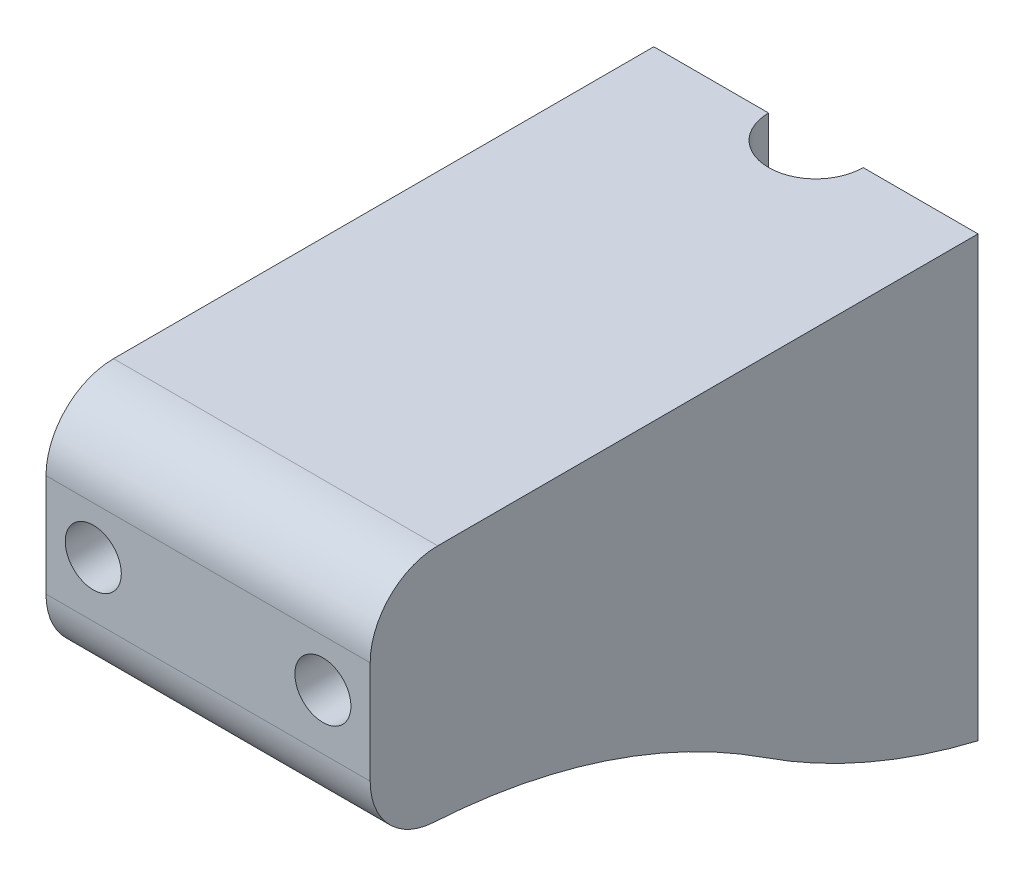
ISO-10303-21;
HEADER;
FILE_DESCRIPTION(('STEP AP214'),'2;1');
FILE_NAME('part.step','',(''),(''),'','','');
FILE_SCHEMA(('AUTOMOTIVE_DESIGN { 1 0 10303 214 1 1 1 1 }'));
ENDSEC;
DATA;
#1=APPLICATION_CONTEXT('core data for automotive mechanical design processes');
#2=APPLICATION_PROTOCOL_DEFINITION('international standard','automotive_design',2000,#1);
#3=PRODUCT_CONTEXT('',#1,'mechanical');
#4=PRODUCT('Part','Part','',(#3));
#5=PRODUCT_RELATED_PRODUCT_CATEGORY('part','',(#4));
#6=PRODUCT_DEFINITION_FORMATION('','',#4);
#7=PRODUCT_DEFINITION_CONTEXT('part definition',#1,'design');
#8=PRODUCT_DEFINITION('design','',#6,#7);
#9=PRODUCT_DEFINITION_SHAPE('','',#8);
#10=(LENGTH_UNIT() NAMED_UNIT(*) SI_UNIT(.MILLI.,.METRE.));
#11=(NAMED_UNIT(*) PLANE_ANGLE_UNIT() SI_UNIT($,.RADIAN.));
#12=(NAMED_UNIT(*) SI_UNIT($,.STERADIAN.) SOLID_ANGLE_UNIT());
#13=UNCERTAINTY_MEASURE_WITH_UNIT(LENGTH_MEASURE(1.E-05),#10,'distance_accuracy_value','');
#14=(GEOMETRIC_REPRESENTATION_CONTEXT(3) GLOBAL_UNCERTAINTY_ASSIGNED_CONTEXT((#13)) GLOBAL_UNIT_ASSIGNED_CONTEXT((#10,
#11,#12)) REPRESENTATION_CONTEXT('',''));
#15=CARTESIAN_POINT('',(0.,0.,0.));
#16=DIRECTION('',(0.,0.,1.));
#17=DIRECTION('',(1.,0.,0.));
#18=AXIS2_PLACEMENT_3D('',#15,#16,#17);
#19=CARTESIAN_POINT('',(24.,70.,-45.));
#20=DIRECTION('',(0.,0.,1.));
#21=DIRECTION('',(1.,0.,0.));
#22=AXIS2_PLACEMENT_3D('',#19,#20,#21);
#23=PLANE('',#22);
#24=CARTESIAN_POINT('',(-17.,53.,-45.));
#25=DIRECTION('',(0.,0.,1.));
#26=DIRECTION('',(1.,0.,0.));
#27=AXIS2_PLACEMENT_3D('',#24,#25,#26);
#28=CIRCLE('',#27,4.15);
#29=CARTESIAN_POINT('',(-12.85,53.,-45.));
#30=VERTEX_POINT('',#29);
#31=EDGE_CURVE('E213',#30,#30,#28,.T.);
#32=ORIENTED_EDGE('',*,*,#31,.T.);
#33=EDGE_LOOP('',(#32));
#34=FACE_BOUND('',#33,.T.);
#35=DIRECTION('',(0.,-1.,0.));
#36=VECTOR('',#35,1.);
#37=CARTESIAN_POINT('',(-7.,244.504586917703,-45.));
#38=LINE('',#37,#36);
#39=CARTESIAN_POINT('',(-7.,70.,-45.));
#40=VERTEX_POINT('',#39);
#41=CARTESIAN_POINT('',(-7.,5.,-45.));
#42=VERTEX_POINT('',#41);
#43=EDGE_CURVE('E158',#40,#42,#38,.T.);
#44=ORIENTED_EDGE('',*,*,#43,.T.);
#45=DIRECTION('',(1.,0.,0.));
#46=VECTOR('',#45,1.);
#47=CARTESIAN_POINT('',(-7.,5.,-45.));
#48=LINE('',#47,#46);
#49=CARTESIAN_POINT('',(-24.,5.,-45.));
#50=VERTEX_POINT('',#49);
#51=EDGE_CURVE('E156',#50,#42,#48,.T.);
#52=ORIENTED_EDGE('',*,*,#51,.F.);
#53=DIRECTION('',(0.,-1.,0.));
#54=VECTOR('',#53,1.);
#55=CARTESIAN_POINT('',(-24.,70.,-45.));
#56=LINE('',#55,#54);
#57=CARTESIAN_POINT('',(-24.,70.,-45.));
#58=VERTEX_POINT('',#57);
#59=EDGE_CURVE('E141',#58,#50,#56,.T.);
#60=ORIENTED_EDGE('',*,*,#59,.F.);
#61=DIRECTION('',(-1.,0.,0.));
#62=VECTOR('',#61,1.);
#63=CARTESIAN_POINT('',(24.,70.,-45.));
#64=LINE('',#63,#62);
#65=EDGE_CURVE('E221',#40,#58,#64,.T.);
#66=ORIENTED_EDGE('',*,*,#65,.F.);
#67=EDGE_LOOP('',(#44,#52,#60,#66));
#68=FACE_BOUND('',#67,.T.);
#69=ADVANCED_FACE('F35',(#34,#68),#23,.F.);
#70=CARTESIAN_POINT('',(17.,53.,-45.));
#71=DIRECTION('',(0.,0.,1.));
#72=DIRECTION('',(1.,0.,0.));
#73=AXIS2_PLACEMENT_3D('',#70,#71,#72);
#74=CIRCLE('',#73,4.15);
#75=CARTESIAN_POINT('',(21.15,53.,-45.));
#76=VERTEX_POINT('',#75);
#77=EDGE_CURVE('E274',#76,#76,#74,.T.);
#78=ORIENTED_EDGE('',*,*,#77,.T.);
#79=EDGE_LOOP('',(#78));
#80=FACE_BOUND('',#79,.T.);
#81=DIRECTION('',(0.,-1.,0.));
#82=VECTOR('',#81,1.);
#83=CARTESIAN_POINT('',(24.,70.,-45.));
#84=LINE('',#83,#82);
#85=CARTESIAN_POINT('',(24.,70.,-45.));
#86=VERTEX_POINT('',#85);
#87=CARTESIAN_POINT('',(24.,5.,-45.));
#88=VERTEX_POINT('',#87);
#89=EDGE_CURVE('E151',#86,#88,#84,.T.);
#90=ORIENTED_EDGE('',*,*,#89,.T.);
#91=DIRECTION('',(1.,0.,0.));
#92=VECTOR('',#91,1.);
#93=CARTESIAN_POINT('',(24.,5.,-45.));
#94=LINE('',#93,#92);
#95=CARTESIAN_POINT('',(7.,5.,-45.));
#96=VERTEX_POINT('',#95);
#97=EDGE_CURVE('E160',#96,#88,#94,.T.);
#98=ORIENTED_EDGE('',*,*,#97,.F.);
#99=DIRECTION('',(0.,-1.,0.));
#100=VECTOR('',#99,1.);
#101=CARTESIAN_POINT('',(7.,244.504586917703,-45.));
#102=LINE('',#101,#100);
#103=CARTESIAN_POINT('',(7.,70.,-45.));
#104=VERTEX_POINT('',#103);
#105=EDGE_CURVE('E282',#104,#96,#102,.T.);
#106=ORIENTED_EDGE('',*,*,#105,.F.);
#107=EDGE_CURVE('E152',#86,#104,#64,.T.);
#108=ORIENTED_EDGE('',*,*,#107,.F.);
#109=EDGE_LOOP('',(#90,#98,#106,#108));
#110=FACE_BOUND('',#109,.T.);
#111=ADVANCED_FACE('F289',(#80,#110),#23,.F.);
#112=CARTESIAN_POINT('',(0.,70.,0.));
#113=DIRECTION('',(0.,1.,0.));
#114=DIRECTION('',(0.,0.,1.));
#115=AXIS2_PLACEMENT_3D('',#112,#113,#114);
#116=PLANE('',#115);
#117=DIRECTION('',(0.,0.,1.));
#118=VECTOR('',#117,1.);
#119=CARTESIAN_POINT('',(-24.,70.,45.));
#120=LINE('',#119,#118);
#121=CARTESIAN_POINT('',(-24.,70.,35.));
#122=VERTEX_POINT('',#121);
#123=EDGE_CURVE('E148',#58,#122,#120,.T.);
#124=ORIENTED_EDGE('',*,*,#123,.T.);
#125=DIRECTION('',(1.,0.,0.));
#126=VECTOR('',#125,1.);
#127=CARTESIAN_POINT('',(24.,70.,35.));
#128=LINE('',#127,#126);
#129=CARTESIAN_POINT('',(24.,70.,35.));
#130=VERTEX_POINT('',#129);
#131=EDGE_CURVE('E181',#122,#130,#128,.T.);
#132=ORIENTED_EDGE('',*,*,#131,.T.);
#133=DIRECTION('',(0.,0.,-1.));
#134=VECTOR('',#133,1.);
#135=CARTESIAN_POINT('',(24.,70.,45.));
#136=LINE('',#135,#134);
#137=EDGE_CURVE('E222',#130,#86,#136,.T.);
#138=ORIENTED_EDGE('',*,*,#137,.T.);
#139=ORIENTED_EDGE('',*,*,#107,.T.);
#140=CARTESIAN_POINT('',(0.,70.,-45.));
#141=DIRECTION('',(0.,1.,0.));
#142=DIRECTION('',(0.,0.,1.));
#143=AXIS2_PLACEMENT_3D('',#140,#141,#142);
#144=CIRCLE('',#143,7.);
#145=EDGE_CURVE('E278',#104,#40,#144,.F.);
#146=ORIENTED_EDGE('',*,*,#145,.T.);
#147=ORIENTED_EDGE('',*,*,#65,.T.);
#148=EDGE_LOOP('',(#124,#132,#138,#139,#146,#147));
#149=FACE_BOUND('',#148,.T.);
#150=ADVANCED_FACE('F307',(#149),#116,.T.);
#151=CARTESIAN_POINT('',(21.,0.,0.));
#152=DIRECTION('',(1.,0.,0.));
#153=DIRECTION('',(0.,0.,-1.));
#154=AXIS2_PLACEMENT_3D('',#151,#152,#153);
#155=PLANE('',#154);
#156=DIRECTION('',(0.,1.,0.));
#157=VECTOR('',#156,1.);
#158=CARTESIAN_POINT('',(21.,42.8,26.3));
#159=LINE('',#158,#157);
#160=CARTESIAN_POINT('',(21.,54.1056672193748,26.3));
#161=VERTEX_POINT('',#160);
#162=CARTESIAN_POINT('',(21.,63.2,26.3));
#163=VERTEX_POINT('',#162);
#164=EDGE_CURVE('E243',#161,#163,#159,.T.);
#165=ORIENTED_EDGE('',*,*,#164,.F.);
#166=DIRECTION('',(0.,0.,1.));
#167=VECTOR('',#166,1.);
#168=CARTESIAN_POINT('',(21.,54.1056672193748,-45.));
#169=LINE('',#168,#167);
#170=CARTESIAN_POINT('',(21.,54.1056672193748,36.7));
#171=VERTEX_POINT('',#170);
#172=EDGE_CURVE('E200',#161,#171,#169,.T.);
#173=ORIENTED_EDGE('',*,*,#172,.T.);
#174=DIRECTION('',(0.,-1.,0.));
#175=VECTOR('',#174,1.);
#176=CARTESIAN_POINT('',(21.,42.8,36.7));
#177=LINE('',#176,#175);
#178=CARTESIAN_POINT('',(21.,63.2,36.7));
#179=VERTEX_POINT('',#178);
#180=EDGE_CURVE('E247',#179,#171,#177,.T.);
#181=ORIENTED_EDGE('',*,*,#180,.F.);
#182=DIRECTION('',(0.,0.,1.));
#183=VECTOR('',#182,1.);
#184=CARTESIAN_POINT('',(21.,63.2,26.3));
#185=LINE('',#184,#183);
#186=EDGE_CURVE('E236',#163,#179,#185,.T.);
#187=ORIENTED_EDGE('',*,*,#186,.F.);
#188=EDGE_LOOP('',(#165,#173,#181,#187));
#189=FACE_BOUND('',#188,.T.);
#190=ADVANCED_FACE('F321',(#189),#155,.F.);
#191=CARTESIAN_POINT('',(-24.,70.,45.));
#192=DIRECTION('',(1.,0.,0.));
#193=DIRECTION('',(0.,0.,-1.));
#194=AXIS2_PLACEMENT_3D('',#191,#192,#193);
#195=PLANE('',#194);
#196=DIRECTION('',(0.,0.,1.));
#197=VECTOR('',#196,1.);
#198=CARTESIAN_POINT('',(-24.,63.2,26.3));
#199=LINE('',#198,#197);
#200=CARTESIAN_POINT('',(-24.,63.2,26.3));
#201=VERTEX_POINT('',#200);
#202=CARTESIAN_POINT('',(-24.,63.2,36.7));
#203=VERTEX_POINT('',#202);
#204=EDGE_CURVE('E230',#201,#203,#199,.T.);
#205=ORIENTED_EDGE('',*,*,#204,.T.);
#206=DIRECTION('',(0.,-1.,0.));
#207=VECTOR('',#206,1.);
#208=CARTESIAN_POINT('',(-24.,42.8,36.7));
#209=LINE('',#208,#207);
#210=CARTESIAN_POINT('',(-24.,42.8,36.7));
#211=VERTEX_POINT('',#210);
#212=EDGE_CURVE('E239',#203,#211,#209,.T.);
#213=ORIENTED_EDGE('',*,*,#212,.T.);
#214=DIRECTION('',(0.,0.,-1.));
#215=VECTOR('',#214,1.);
#216=CARTESIAN_POINT('',(-24.,42.8,26.3));
#217=LINE('',#216,#215);
#218=CARTESIAN_POINT('',(-24.,42.8,26.3));
#219=VERTEX_POINT('',#218);
#220=EDGE_CURVE('E256',#211,#219,#217,.T.);
#221=ORIENTED_EDGE('',*,*,#220,.T.);
#222=DIRECTION('',(0.,1.,0.));
#223=VECTOR('',#222,1.);
#224=CARTESIAN_POINT('',(-24.,42.8,26.3));
#225=LINE('',#224,#223);
#226=EDGE_CURVE('E253',#219,#201,#225,.T.);
#227=ORIENTED_EDGE('',*,*,#226,.T.);
#228=EDGE_LOOP('',(#205,#213,#221,#227));
#229=FACE_BOUND('',#228,.T.);
#230=CARTESIAN_POINT('',(-24.,-65.,41.3970234266202));
#231=DIRECTION('',(1.,0.,0.));
#232=DIRECTION('',(0.,0.,-1.));
#233=AXIS2_PLACEMENT_3D('',#230,#231,#232);
#234=CIRCLE('',#233,100.);
#235=CARTESIAN_POINT('',(-24.,18.6283238276554,-13.4327445263523));
#236=VERTEX_POINT('',#235);
#237=CARTESIAN_POINT('',(-24.,34.8307579893425,35.5815475842382));
#238=VERTEX_POINT('',#237);
#239=EDGE_CURVE('E197',#236,#238,#234,.T.);
#240=ORIENTED_EDGE('',*,*,#239,.T.);
#241=CARTESIAN_POINT('',(-24.,44.8138337882767,35.));
#242=DIRECTION('',(1.,0.,0.));
#243=DIRECTION('',(0.,0.,-1.));
#244=AXIS2_PLACEMENT_3D('',#241,#242,#243);
#245=CIRCLE('',#244,10.);
#246=CARTESIAN_POINT('',(-24.,44.8138337882767,45.));
#247=VERTEX_POINT('',#246);
#248=EDGE_CURVE('E57',#238,#247,#245,.F.);
#249=ORIENTED_EDGE('',*,*,#248,.T.);
#250=DIRECTION('',(0.,-1.,0.));
#251=VECTOR('',#250,1.);
#252=CARTESIAN_POINT('',(-24.,70.,45.));
#253=LINE('',#252,#251);
#254=CARTESIAN_POINT('',(-24.,60.,45.));
#255=VERTEX_POINT('',#254);
#256=EDGE_CURVE('E208',#255,#247,#253,.T.);
#257=ORIENTED_EDGE('',*,*,#256,.F.);
#258=CARTESIAN_POINT('',(-24.,60.,35.));
#259=DIRECTION('',(1.,0.,0.));
#260=DIRECTION('',(0.,0.,-1.));
#261=AXIS2_PLACEMENT_3D('',#258,#259,#260);
#262=CIRCLE('',#261,10.);
#263=EDGE_CURVE('E188',#255,#122,#262,.F.);
#264=ORIENTED_EDGE('',*,*,#263,.T.);
#265=ORIENTED_EDGE('',*,*,#123,.F.);
#266=ORIENTED_EDGE('',*,*,#59,.T.);
#267=CARTESIAN_POINT('',(-24.,102.256647655311,-68.2625124793248));
#268=DIRECTION('',(1.,0.,0.));
#269=DIRECTION('',(0.,0.,-1.));
#270=AXIS2_PLACEMENT_3D('',#267,#268,#269);
#271=CIRCLE('',#270,100.);
#272=EDGE_CURVE('E145',#50,#236,#271,.F.);
#273=ORIENTED_EDGE('',*,*,#272,.T.);
#274=EDGE_LOOP('',(#240,#249,#257,#264,#265,#266,#273));
#275=FACE_BOUND('',#274,.T.);
#276=ADVANCED_FACE('F143',(#229,#275),#195,.F.);
#277=CARTESIAN_POINT('',(24.,70.,45.));
#278=DIRECTION('',(0.,0.,-1.));
#279=DIRECTION('',(-1.,0.,0.));
#280=AXIS2_PLACEMENT_3D('',#277,#278,#279);
#281=PLANE('',#280);
#282=CARTESIAN_POINT('',(17.,53.,45.));
#283=DIRECTION('',(0.,0.,1.));
#284=DIRECTION('',(1.,0.,0.));
#285=AXIS2_PLACEMENT_3D('',#282,#283,#284);
#286=CIRCLE('',#285,4.15);
#287=CARTESIAN_POINT('',(21.15,53.,45.));
#288=VERTEX_POINT('',#287);
#289=EDGE_CURVE('E275',#288,#288,#286,.T.);
#290=ORIENTED_EDGE('',*,*,#289,.F.);
#291=EDGE_LOOP('',(#290));
#292=FACE_BOUND('',#291,.T.);
#293=CARTESIAN_POINT('',(-17.,53.,45.));
#294=DIRECTION('',(0.,0.,1.));
#295=DIRECTION('',(1.,0.,0.));
#296=AXIS2_PLACEMENT_3D('',#293,#294,#295);
#297=CIRCLE('',#296,4.15);
#298=CARTESIAN_POINT('',(-12.85,53.,45.));
#299=VERTEX_POINT('',#298);
#300=EDGE_CURVE('E263',#299,#299,#297,.T.);
#301=ORIENTED_EDGE('',*,*,#300,.F.);
#302=EDGE_LOOP('',(#301));
#303=FACE_BOUND('',#302,.T.);
#304=ORIENTED_EDGE('',*,*,#256,.T.);
#305=DIRECTION('',(-1.,0.,0.));
#306=VECTOR('',#305,1.);
#307=CARTESIAN_POINT('',(24.,44.8138337882767,45.));
#308=LINE('',#307,#306);
#309=CARTESIAN_POINT('',(24.,44.8138337882767,45.));
#310=VERTEX_POINT('',#309);
#311=EDGE_CURVE('E43',#247,#310,#308,.F.);
#312=ORIENTED_EDGE('',*,*,#311,.T.);
#313=DIRECTION('',(0.,-1.,0.));
#314=VECTOR('',#313,1.);
#315=CARTESIAN_POINT('',(24.,70.,45.));
#316=LINE('',#315,#314);
#317=CARTESIAN_POINT('',(24.,60.,45.));
#318=VERTEX_POINT('',#317);
#319=EDGE_CURVE('E215',#318,#310,#316,.T.);
#320=ORIENTED_EDGE('',*,*,#319,.F.);
#321=DIRECTION('',(1.,0.,0.));
#322=VECTOR('',#321,1.);
#323=CARTESIAN_POINT('',(-24.,60.,45.));
#324=LINE('',#323,#322);
#325=EDGE_CURVE('E186',#318,#255,#324,.F.);
#326=ORIENTED_EDGE('',*,*,#325,.T.);
#327=EDGE_LOOP('',(#304,#312,#320,#326));
#328=FACE_BOUND('',#327,.T.);
#329=ADVANCED_FACE('F315',(#292,#303,#328),#281,.F.);
#330=CARTESIAN_POINT('',(24.,70.,45.));
#331=DIRECTION('',(-1.,0.,0.));
#332=DIRECTION('',(0.,0.,1.));
#333=AXIS2_PLACEMENT_3D('',#330,#331,#332);
#334=PLANE('',#333);
#335=ORIENTED_EDGE('',*,*,#319,.T.);
#336=CARTESIAN_POINT('',(24.,44.8138337882767,35.));
#337=DIRECTION('',(-1.,0.,0.));
#338=DIRECTION('',(0.,0.,1.));
#339=AXIS2_PLACEMENT_3D('',#336,#337,#338);
#340=CIRCLE('',#339,10.);
#341=CARTESIAN_POINT('',(24.,34.8307579893425,35.5815475842382));
#342=VERTEX_POINT('',#341);
#343=EDGE_CURVE('E11',#310,#342,#340,.F.);
#344=ORIENTED_EDGE('',*,*,#343,.T.);
#345=CARTESIAN_POINT('',(24.,-65.,41.3970234266202));
#346=DIRECTION('',(-1.,0.,0.));
#347=DIRECTION('',(0.,0.,1.));
#348=AXIS2_PLACEMENT_3D('',#345,#346,#347);
#349=CIRCLE('',#348,100.);
#350=CARTESIAN_POINT('',(24.,18.6283238276554,-13.4327445263523));
#351=VERTEX_POINT('',#350);
#352=EDGE_CURVE('E171',#342,#351,#349,.T.);
#353=ORIENTED_EDGE('',*,*,#352,.T.);
#354=CARTESIAN_POINT('',(24.,102.256647655311,-68.2625124793248));
#355=DIRECTION('',(-1.,0.,0.));
#356=DIRECTION('',(0.,0.,1.));
#357=AXIS2_PLACEMENT_3D('',#354,#355,#356);
#358=CIRCLE('',#357,100.);
#359=EDGE_CURVE('E169',#351,#88,#358,.F.);
#360=ORIENTED_EDGE('',*,*,#359,.T.);
#361=ORIENTED_EDGE('',*,*,#89,.F.);
#362=ORIENTED_EDGE('',*,*,#137,.F.);
#363=CARTESIAN_POINT('',(24.,60.,35.));
#364=DIRECTION('',(-1.,0.,0.));
#365=DIRECTION('',(0.,0.,1.));
#366=AXIS2_PLACEMENT_3D('',#363,#364,#365);
#367=CIRCLE('',#366,10.);
#368=EDGE_CURVE('E184',#130,#318,#367,.F.);
#369=ORIENTED_EDGE('',*,*,#368,.T.);
#370=EDGE_LOOP('',(#335,#344,#353,#360,#361,#362,#369));
#371=FACE_BOUND('',#370,.T.);
#372=ADVANCED_FACE('F294',(#371),#334,.F.);
#373=CARTESIAN_POINT('',(-24.,42.8,36.7));
#374=DIRECTION('',(0.,0.,1.));
#375=DIRECTION('',(1.,0.,0.));
#376=AXIS2_PLACEMENT_3D('',#373,#374,#375);
#377=PLANE('',#376);
#378=CARTESIAN_POINT('',(-17.,53.,36.7));
#379=DIRECTION('',(0.,0.,1.));
#380=DIRECTION('',(1.,0.,0.));
#381=AXIS2_PLACEMENT_3D('',#378,#379,#380);
#382=CIRCLE('',#381,4.15);
#383=CARTESIAN_POINT('',(-12.85,53.,36.7));
#384=VERTEX_POINT('',#383);
#385=EDGE_CURVE('E212',#384,#384,#382,.T.);
#386=ORIENTED_EDGE('',*,*,#385,.T.);
#387=EDGE_LOOP('',(#386));
#388=FACE_BOUND('',#387,.T.);
#389=ORIENTED_EDGE('',*,*,#180,.T.);
#390=CARTESIAN_POINT('',(17.,53.,36.7));
#391=DIRECTION('',(0.,0.,1.));
#392=DIRECTION('',(1.,0.,0.));
#393=AXIS2_PLACEMENT_3D('',#390,#391,#392);
#394=CIRCLE('',#393,4.15);
#395=CARTESIAN_POINT('',(21.,51.8943327806252,36.7));
#396=VERTEX_POINT('',#395);
#397=EDGE_CURVE('E266',#171,#396,#394,.T.);
#398=ORIENTED_EDGE('',*,*,#397,.T.);
#399=CARTESIAN_POINT('',(21.,42.8,36.7));
#400=VERTEX_POINT('',#399);
#401=EDGE_CURVE('E250',#396,#400,#177,.T.);
#402=ORIENTED_EDGE('',*,*,#401,.T.);
#403=DIRECTION('',(1.,0.,0.));
#404=VECTOR('',#403,1.);
#405=CARTESIAN_POINT('',(-24.,42.8,36.7));
#406=LINE('',#405,#404);
#407=EDGE_CURVE('E226',#211,#400,#406,.T.);
#408=ORIENTED_EDGE('',*,*,#407,.F.);
#409=ORIENTED_EDGE('',*,*,#212,.F.);
#410=DIRECTION('',(1.,0.,0.));
#411=VECTOR('',#410,1.);
#412=CARTESIAN_POINT('',(-24.,63.2,36.7));
#413=LINE('',#412,#411);
#414=EDGE_CURVE('E225',#203,#179,#413,.T.);
#415=ORIENTED_EDGE('',*,*,#414,.T.);
#416=EDGE_LOOP('',(#389,#398,#402,#408,#409,#415));
#417=FACE_BOUND('',#416,.T.);
#418=ADVANCED_FACE('F314',(#388,#417),#377,.F.);
#419=CARTESIAN_POINT('',(-24.,63.2,26.3));
#420=DIRECTION('',(0.,1.,0.));
#421=DIRECTION('',(0.,0.,1.));
#422=AXIS2_PLACEMENT_3D('',#419,#420,#421);
#423=PLANE('',#422);
#424=ORIENTED_EDGE('',*,*,#186,.T.);
#425=ORIENTED_EDGE('',*,*,#414,.F.);
#426=ORIENTED_EDGE('',*,*,#204,.F.);
#427=DIRECTION('',(1.,0.,0.));
#428=VECTOR('',#427,1.);
#429=CARTESIAN_POINT('',(-24.,63.2,26.3));
#430=LINE('',#429,#428);
#431=EDGE_CURVE('E232',#201,#163,#430,.T.);
#432=ORIENTED_EDGE('',*,*,#431,.T.);
#433=EDGE_LOOP('',(#424,#425,#426,#432));
#434=FACE_BOUND('',#433,.T.);
#435=ADVANCED_FACE('F371',(#434),#423,.F.);
#436=CARTESIAN_POINT('',(-24.,42.8,26.3));
#437=DIRECTION('',(0.,0.,-1.));
#438=DIRECTION('',(0.,1.,0.));
#439=AXIS2_PLACEMENT_3D('',#436,#437,#438);
#440=PLANE('',#439);
#441=CARTESIAN_POINT('',(-17.,53.,26.3));
#442=DIRECTION('',(0.,0.,-1.));
#443=DIRECTION('',(0.,1.,0.));
#444=AXIS2_PLACEMENT_3D('',#441,#442,#443);
#445=CIRCLE('',#444,4.15);
#446=CARTESIAN_POINT('',(-12.85,53.,26.3));
#447=VERTEX_POINT('',#446);
#448=EDGE_CURVE('E209',#447,#447,#445,.T.);
#449=ORIENTED_EDGE('',*,*,#448,.T.);
#450=EDGE_LOOP('',(#449));
#451=FACE_BOUND('',#450,.T.);
#452=CARTESIAN_POINT('',(21.,42.8,26.3));
#453=VERTEX_POINT('',#452);
#454=CARTESIAN_POINT('',(21.,51.8943327806252,26.3));
#455=VERTEX_POINT('',#454);
#456=EDGE_CURVE('E240',#453,#455,#159,.T.);
#457=ORIENTED_EDGE('',*,*,#456,.T.);
#458=CARTESIAN_POINT('',(17.,53.,26.3));
#459=DIRECTION('',(0.,0.,-1.));
#460=DIRECTION('',(0.,1.,0.));
#461=AXIS2_PLACEMENT_3D('',#458,#459,#460);
#462=CIRCLE('',#461,4.15);
#463=EDGE_CURVE('E271',#455,#161,#462,.T.);
#464=ORIENTED_EDGE('',*,*,#463,.T.);
#465=ORIENTED_EDGE('',*,*,#164,.T.);
#466=ORIENTED_EDGE('',*,*,#431,.F.);
#467=ORIENTED_EDGE('',*,*,#226,.F.);
#468=DIRECTION('',(1.,0.,0.));
#469=VECTOR('',#468,1.);
#470=CARTESIAN_POINT('',(-24.,42.8,26.3));
#471=LINE('',#470,#469);
#472=EDGE_CURVE('E229',#219,#453,#471,.T.);
#473=ORIENTED_EDGE('',*,*,#472,.T.);
#474=EDGE_LOOP('',(#457,#464,#465,#466,#467,#473));
#475=FACE_BOUND('',#474,.T.);
#476=ADVANCED_FACE('F380',(#451,#475),#440,.F.);
#477=CARTESIAN_POINT('',(-24.,42.8,26.3));
#478=DIRECTION('',(0.,-1.,0.));
#479=DIRECTION('',(0.,0.,-1.));
#480=AXIS2_PLACEMENT_3D('',#477,#478,#479);
#481=PLANE('',#480);
#482=DIRECTION('',(0.,0.,-1.));
#483=VECTOR('',#482,1.);
#484=CARTESIAN_POINT('',(21.,42.8,26.3));
#485=LINE('',#484,#483);
#486=EDGE_CURVE('E244',#400,#453,#485,.T.);
#487=ORIENTED_EDGE('',*,*,#486,.T.);
#488=ORIENTED_EDGE('',*,*,#472,.F.);
#489=ORIENTED_EDGE('',*,*,#220,.F.);
#490=ORIENTED_EDGE('',*,*,#407,.T.);
#491=EDGE_LOOP('',(#487,#488,#489,#490));
#492=FACE_BOUND('',#491,.T.);
#493=ADVANCED_FACE('F388',(#492),#481,.F.);
#494=ORIENTED_EDGE('',*,*,#401,.F.);
#495=DIRECTION('',(0.,0.,1.));
#496=VECTOR('',#495,1.);
#497=CARTESIAN_POINT('',(21.,51.8943327806252,-45.));
#498=LINE('',#497,#496);
#499=EDGE_CURVE('E203',#396,#455,#498,.F.);
#500=ORIENTED_EDGE('',*,*,#499,.T.);
#501=ORIENTED_EDGE('',*,*,#456,.F.);
#502=ORIENTED_EDGE('',*,*,#486,.F.);
#503=EDGE_LOOP('',(#494,#500,#501,#502));
#504=FACE_BOUND('',#503,.T.);
#505=ADVANCED_FACE('F396',(#504),#155,.F.);
#506=CARTESIAN_POINT('',(-17.,53.,-45.));
#507=DIRECTION('',(0.,0.,1.));
#508=DIRECTION('',(1.,0.,0.));
#509=AXIS2_PLACEMENT_3D('',#506,#507,#508);
#510=CYLINDRICAL_SURFACE('',#509,4.15);
#511=CARTESIAN_POINT('',(-12.85,53.,-45.));
#512=CARTESIAN_POINT('',(-12.85,53.,-44.2572916666667));
#513=CARTESIAN_POINT('',(-12.85,53.,-43.5145833333333));
#514=CARTESIAN_POINT('',(-12.85,53.,-42.0291666666667));
#515=CARTESIAN_POINT('',(-12.85,53.,-41.2864583333333));
#516=CARTESIAN_POINT('',(-12.85,53.,-39.8010416666667));
#517=CARTESIAN_POINT('',(-12.85,53.,-39.0583333333333));
#518=CARTESIAN_POINT('',(-12.85,53.,-37.5729166666667));
#519=CARTESIAN_POINT('',(-12.85,53.,-36.8302083333333));
#520=CARTESIAN_POINT('',(-12.85,53.,-35.3447916666667));
#521=CARTESIAN_POINT('',(-12.85,53.,-34.6020833333333));
#522=CARTESIAN_POINT('',(-12.85,53.,-33.1166666666667));
#523=CARTESIAN_POINT('',(-12.85,53.,-32.3739583333333));
#524=CARTESIAN_POINT('',(-12.85,53.,-30.8885416666667));
#525=CARTESIAN_POINT('',(-12.85,53.,-30.1458333333333));
#526=CARTESIAN_POINT('',(-12.85,53.,-28.6604166666667));
#527=CARTESIAN_POINT('',(-12.85,53.,-27.9177083333333));
#528=CARTESIAN_POINT('',(-12.85,53.,-26.4322916666667));
#529=CARTESIAN_POINT('',(-12.85,53.,-25.6895833333333));
#530=CARTESIAN_POINT('',(-12.85,53.,-24.2041666666667));
#531=CARTESIAN_POINT('',(-12.85,53.,-23.4614583333333));
#532=CARTESIAN_POINT('',(-12.85,53.,-21.9760416666667));
#533=CARTESIAN_POINT('',(-12.85,53.,-21.2333333333333));
#534=CARTESIAN_POINT('',(-12.85,53.,-19.7479166666667));
#535=CARTESIAN_POINT('',(-12.85,53.,-19.0052083333333));
#536=CARTESIAN_POINT('',(-12.85,53.,-17.5197916666667));
#537=CARTESIAN_POINT('',(-12.85,53.,-16.7770833333333));
#538=CARTESIAN_POINT('',(-12.85,53.,-15.2916666666667));
#539=CARTESIAN_POINT('',(-12.85,53.,-14.5489583333333));
#540=CARTESIAN_POINT('',(-12.85,53.,-13.0635416666667));
#541=CARTESIAN_POINT('',(-12.85,53.,-12.3208333333333));
#542=CARTESIAN_POINT('',(-12.85,53.,-10.8354166666667));
#543=CARTESIAN_POINT('',(-12.85,53.,-10.0927083333333));
#544=CARTESIAN_POINT('',(-12.85,53.,-8.60729166666667));
#545=CARTESIAN_POINT('',(-12.85,53.,-7.86458333333333));
#546=CARTESIAN_POINT('',(-12.85,53.,-6.37916666666666));
#547=CARTESIAN_POINT('',(-12.85,53.,-5.63645833333333));
#548=CARTESIAN_POINT('',(-12.85,53.,-4.15104166666666));
#549=CARTESIAN_POINT('',(-12.85,53.,-3.40833333333333));
#550=CARTESIAN_POINT('',(-12.85,53.,-1.92291666666666));
#551=CARTESIAN_POINT('',(-12.85,53.,-1.18020833333333));
#552=CARTESIAN_POINT('',(-12.85,53.,0.305208333333339));
#553=CARTESIAN_POINT('',(-12.85,53.,1.04791666666667));
#554=CARTESIAN_POINT('',(-12.85,53.,2.53333333333334));
#555=CARTESIAN_POINT('',(-12.85,53.,3.27604166666667));
#556=CARTESIAN_POINT('',(-12.85,53.,4.76145833333334));
#557=CARTESIAN_POINT('',(-12.85,53.,5.50416666666667));
#558=CARTESIAN_POINT('',(-12.85,53.,6.98958333333334));
#559=CARTESIAN_POINT('',(-12.85,53.,7.73229166666667));
#560=CARTESIAN_POINT('',(-12.85,53.,9.21770833333334));
#561=CARTESIAN_POINT('',(-12.85,53.,9.96041666666667));
#562=CARTESIAN_POINT('',(-12.85,53.,11.4458333333333));
#563=CARTESIAN_POINT('',(-12.85,53.,12.1885416666667));
#564=CARTESIAN_POINT('',(-12.85,53.,13.6739583333333));
#565=CARTESIAN_POINT('',(-12.85,53.,14.4166666666667));
#566=CARTESIAN_POINT('',(-12.85,53.,15.9020833333333));
#567=CARTESIAN_POINT('',(-12.85,53.,16.6447916666667));
#568=CARTESIAN_POINT('',(-12.85,53.,18.1302083333333));
#569=CARTESIAN_POINT('',(-12.85,53.,18.8729166666667));
#570=CARTESIAN_POINT('',(-12.85,53.,20.3583333333333));
#571=CARTESIAN_POINT('',(-12.85,53.,21.1010416666667));
#572=CARTESIAN_POINT('',(-12.85,53.,22.5864583333333));
#573=CARTESIAN_POINT('',(-12.85,53.,23.3291666666667));
#574=CARTESIAN_POINT('',(-12.85,53.,24.8145833333333));
#575=CARTESIAN_POINT('',(-12.85,53.,25.5572916666667));
#576=CARTESIAN_POINT('',(-12.85,53.,26.3));
#577=B_SPLINE_CURVE_WITH_KNOTS('',3,(#511,#512,#513,#514,#515,#516,#517,#518,#519,#520,#521,
#522,#523,#524,#525,#526,#527,#528,#529,#530,#531,#532,#533,#534,#535,#536,#537,#538,#539,#540,
#541,#542,#543,#544,#545,#546,#547,#548,#549,#550,#551,#552,#553,#554,#555,#556,#557,#558,#559,
#560,#561,#562,#563,#564,#565,#566,#567,#568,#569,#570,#571,#572,#573,#574,#575,#576),
.UNSPECIFIED.,.F.,.F.,(4,2,2,2,2,2,2,2,2,2,2,2,2,2,2,2,2,2,2,2,2,2,2,2,2,2,2,2,2,2,2,2,4),(0.,
2.228125,4.45625,6.684375,8.9125,11.140625,13.36875,15.596875,17.825,20.053125,22.28125,
24.509375,26.7375,28.965625,31.19375,33.421875,35.65,37.878125,40.10625,42.334375,44.5625,
46.790625,49.01875,51.246875,53.475,55.703125,57.93125,60.159375,62.3875,64.615625,66.84375,
69.071875,71.3),.UNSPECIFIED.);
#578=EDGE_CURVE('BSEAM403',#30,#447,#577,.T.);
#579=ORIENTED_EDGE('',*,*,#31,.F.);
#580=ORIENTED_EDGE('',*,*,#448,.F.);
#581=ORIENTED_EDGE('',*,*,#578,.T.);
#582=ORIENTED_EDGE('',*,*,#578,.F.);
#583=EDGE_LOOP('',(#579,#581,#580,#582));
#584=FACE_BOUND('',#583,.T.);
#585=ADVANCED_FACE('F403',(#584),#510,.F.);
#586=CARTESIAN_POINT('',(-12.85,53.,45.));
#587=CARTESIAN_POINT('',(-12.85,53.,44.9135416666667));
#588=CARTESIAN_POINT('',(-12.85,53.,44.8270833333333));
#589=CARTESIAN_POINT('',(-12.85,53.,44.6541666666667));
#590=CARTESIAN_POINT('',(-12.85,53.,44.5677083333333));
#591=CARTESIAN_POINT('',(-12.85,53.,44.3947916666667));
#592=CARTESIAN_POINT('',(-12.85,53.,44.3083333333333));
#593=CARTESIAN_POINT('',(-12.85,53.,44.1354166666667));
#594=CARTESIAN_POINT('',(-12.85,53.,44.0489583333333));
#595=CARTESIAN_POINT('',(-12.85,53.,43.8760416666667));
#596=CARTESIAN_POINT('',(-12.85,53.,43.7895833333333));
#597=CARTESIAN_POINT('',(-12.85,53.,43.6166666666667));
#598=CARTESIAN_POINT('',(-12.85,53.,43.5302083333333));
#599=CARTESIAN_POINT('',(-12.85,53.,43.3572916666667));
#600=CARTESIAN_POINT('',(-12.85,53.,43.2708333333333));
#601=CARTESIAN_POINT('',(-12.85,53.,43.0979166666667));
#602=CARTESIAN_POINT('',(-12.85,53.,43.0114583333333));
#603=CARTESIAN_POINT('',(-12.85,53.,42.8385416666667));
#604=CARTESIAN_POINT('',(-12.85,53.,42.7520833333333));
#605=CARTESIAN_POINT('',(-12.85,53.,42.5791666666667));
#606=CARTESIAN_POINT('',(-12.85,53.,42.4927083333333));
#607=CARTESIAN_POINT('',(-12.85,53.,42.3197916666667));
#608=CARTESIAN_POINT('',(-12.85,53.,42.2333333333333));
#609=CARTESIAN_POINT('',(-12.85,53.,42.0604166666667));
#610=CARTESIAN_POINT('',(-12.85,53.,41.9739583333333));
#611=CARTESIAN_POINT('',(-12.85,53.,41.8010416666667));
#612=CARTESIAN_POINT('',(-12.85,53.,41.7145833333333));
#613=CARTESIAN_POINT('',(-12.85,53.,41.5416666666667));
#614=CARTESIAN_POINT('',(-12.85,53.,41.4552083333333));
#615=CARTESIAN_POINT('',(-12.85,53.,41.2822916666667));
#616=CARTESIAN_POINT('',(-12.85,53.,41.1958333333333));
#617=CARTESIAN_POINT('',(-12.85,53.,41.0229166666667));
#618=CARTESIAN_POINT('',(-12.85,53.,40.9364583333333));
#619=CARTESIAN_POINT('',(-12.85,53.,40.7635416666667));
#620=CARTESIAN_POINT('',(-12.85,53.,40.6770833333333));
#621=CARTESIAN_POINT('',(-12.85,53.,40.5041666666667));
#622=CARTESIAN_POINT('',(-12.85,53.,40.4177083333333));
#623=CARTESIAN_POINT('',(-12.85,53.,40.2447916666667));
#624=CARTESIAN_POINT('',(-12.85,53.,40.1583333333333));
#625=CARTESIAN_POINT('',(-12.85,53.,39.9854166666667));
#626=CARTESIAN_POINT('',(-12.85,53.,39.8989583333333));
#627=CARTESIAN_POINT('',(-12.85,53.,39.7260416666667));
#628=CARTESIAN_POINT('',(-12.85,53.,39.6395833333333));
#629=CARTESIAN_POINT('',(-12.85,53.,39.4666666666667));
#630=CARTESIAN_POINT('',(-12.85,53.,39.3802083333333));
#631=CARTESIAN_POINT('',(-12.85,53.,39.2072916666667));
#632=CARTESIAN_POINT('',(-12.85,53.,39.1208333333333));
#633=CARTESIAN_POINT('',(-12.85,53.,38.9479166666667));
#634=CARTESIAN_POINT('',(-12.85,53.,38.8614583333333));
#635=CARTESIAN_POINT('',(-12.85,53.,38.6885416666667));
#636=CARTESIAN_POINT('',(-12.85,53.,38.6020833333333));
#637=CARTESIAN_POINT('',(-12.85,53.,38.4291666666667));
#638=CARTESIAN_POINT('',(-12.85,53.,38.3427083333333));
#639=CARTESIAN_POINT('',(-12.85,53.,38.1697916666667));
#640=CARTESIAN_POINT('',(-12.85,53.,38.0833333333333));
#641=CARTESIAN_POINT('',(-12.85,53.,37.9104166666667));
#642=CARTESIAN_POINT('',(-12.85,53.,37.8239583333333));
#643=CARTESIAN_POINT('',(-12.85,53.,37.6510416666667));
#644=CARTESIAN_POINT('',(-12.85,53.,37.5645833333333));
#645=CARTESIAN_POINT('',(-12.85,53.,37.3916666666667));
#646=CARTESIAN_POINT('',(-12.85,53.,37.3052083333333));
#647=CARTESIAN_POINT('',(-12.85,53.,37.1322916666667));
#648=CARTESIAN_POINT('',(-12.85,53.,37.0458333333333));
#649=CARTESIAN_POINT('',(-12.85,53.,36.8729166666667));
#650=CARTESIAN_POINT('',(-12.85,53.,36.7864583333333));
#651=CARTESIAN_POINT('',(-12.85,53.,36.7));
#652=B_SPLINE_CURVE_WITH_KNOTS('',3,(#586,#587,#588,#589,#590,#591,#592,#593,#594,#595,#596,
#597,#598,#599,#600,#601,#602,#603,#604,#605,#606,#607,#608,#609,#610,#611,#612,#613,#614,#615,
#616,#617,#618,#619,#620,#621,#622,#623,#624,#625,#626,#627,#628,#629,#630,#631,#632,#633,#634,
#635,#636,#637,#638,#639,#640,#641,#642,#643,#644,#645,#646,#647,#648,#649,#650,#651),
.UNSPECIFIED.,.F.,.F.,(4,2,2,2,2,2,2,2,2,2,2,2,2,2,2,2,2,2,2,2,2,2,2,2,2,2,2,2,2,2,2,2,4),(0.,
0.259375000000006,0.518749999999998,0.778125000000005,1.0375,1.296875,1.55625,1.815625,
2.07499999999999,2.334375,2.59375000000001,2.853125,3.1125,3.371875,3.63125,3.89062499999999,
4.15,4.40937500000001,4.66875,4.928125,5.1875,5.446875,5.70625,5.965625,6.22500000000001,
6.484375,6.74375000000001,7.003125,7.2625,7.521875,7.78125,8.040625,8.3),.UNSPECIFIED.);
#653=EDGE_CURVE('BSEAM411',#299,#384,#652,.T.);
#654=ORIENTED_EDGE('',*,*,#300,.T.);
#655=ORIENTED_EDGE('',*,*,#385,.F.);
#656=ORIENTED_EDGE('',*,*,#653,.T.);
#657=ORIENTED_EDGE('',*,*,#653,.F.);
#658=EDGE_LOOP('',(#654,#656,#655,#657));
#659=FACE_BOUND('',#658,.T.);
#660=ADVANCED_FACE('F411',(#659),#510,.F.);
#661=CARTESIAN_POINT('',(17.,53.,-45.));
#662=DIRECTION('',(0.,0.,1.));
#663=DIRECTION('',(1.,0.,0.));
#664=AXIS2_PLACEMENT_3D('',#661,#662,#663);
#665=CYLINDRICAL_SURFACE('',#664,4.15);
#666=ORIENTED_EDGE('',*,*,#77,.F.);
#667=EDGE_LOOP('',(#666));
#668=FACE_BOUND('',#667,.T.);
#669=ORIENTED_EDGE('',*,*,#289,.T.);
#670=EDGE_LOOP('',(#669));
#671=FACE_BOUND('',#670,.T.);
#672=ORIENTED_EDGE('',*,*,#463,.F.);
#673=ORIENTED_EDGE('',*,*,#499,.F.);
#674=ORIENTED_EDGE('',*,*,#397,.F.);
#675=ORIENTED_EDGE('',*,*,#172,.F.);
#676=EDGE_LOOP('',(#672,#673,#674,#675));
#677=FACE_BOUND('',#676,.T.);
#678=ADVANCED_FACE('F419',(#668,#671,#677),#665,.F.);
#679=CARTESIAN_POINT('',(0.,244.504586917703,-45.));
#680=DIRECTION('',(0.,-1.,0.));
#681=DIRECTION('',(0.,0.,-1.));
#682=AXIS2_PLACEMENT_3D('',#679,#680,#681);
#683=CYLINDRICAL_SURFACE('',#682,7.);
#684=ORIENTED_EDGE('',*,*,#105,.T.);
#685=CARTESIAN_POINT('',(7.,5.,-45.));
#686=CARTESIAN_POINT('',(7.00001791131792,5.04853340596113,-44.7970618882062));
#687=CARTESIAN_POINT('',(6.9911757867296,5.09771251400582,-44.594286948221));
#688=CARTESIAN_POINT('',(6.95598357561457,5.19696999637947,-44.1904987776324));
#689=CARTESIAN_POINT('',(6.92963479031004,5.24704830360427,-43.9894854172206));
#690=CARTESIAN_POINT('',(6.85965012866287,5.3477066884818,-43.5906754525136));
#691=CARTESIAN_POINT('',(6.81601861130177,5.39828663647892,-43.392878050188));
#692=CARTESIAN_POINT('',(6.71179863998703,5.49953691545137,-43.001825787807));
#693=CARTESIAN_POINT('',(6.65121016623517,5.55020724653216,-42.8085709330555));
#694=CARTESIAN_POINT('',(6.51347753201049,5.65119887540915,-42.4279221855456));
#695=CARTESIAN_POINT('',(6.43633076047658,5.70152011686435,-42.2405292224887));
#696=CARTESIAN_POINT('',(6.26595712217839,5.80135281919233,-41.872885812412));
#697=CARTESIAN_POINT('',(6.17272432933336,5.85086397424414,-41.6926380278731));
#698=CARTESIAN_POINT('',(5.97082564499139,5.94854794913372,-41.3407132777376));
#699=CARTESIAN_POINT('',(5.86216546134672,5.99672125610461,-41.1690331738642));
#700=CARTESIAN_POINT('',(5.6300675215124,6.09124169392916,-40.83543175538));
#701=CARTESIAN_POINT('',(5.50662976266993,6.13758882445499,-40.6735104425211));
#702=CARTESIAN_POINT('',(5.24640258105923,6.22771534670529,-40.3614298013293));
#703=CARTESIAN_POINT('',(5.1096821496553,6.27150629518169,-40.2112163050397));
#704=CARTESIAN_POINT('',(4.82325586456668,6.35625219553186,-39.9228451990227));
#705=CARTESIAN_POINT('',(4.67355000264396,6.39720714560643,-39.7846875969437));
#706=CARTESIAN_POINT('',(4.36213757264801,6.47577020977762,-39.5215595518686));
#707=CARTESIAN_POINT('',(4.20043071479509,6.51337824301033,-39.3965894274777));
#708=CARTESIAN_POINT('',(3.86613912037792,6.58474564855415,-39.1609260916505));
#709=CARTESIAN_POINT('',(3.69355519164982,6.61850530616091,-39.0502318218073));
#710=CARTESIAN_POINT('',(3.34454388652377,6.68067179108979,-38.8474871446246));
#711=CARTESIAN_POINT('',(3.1684264745407,6.70921750332754,-38.7549456422401));
#712=CARTESIAN_POINT('',(2.80847357060182,6.76186300177546,-38.5850122622669));
#713=CARTESIAN_POINT('',(2.62464130282308,6.78596462297878,-38.5076141310748));
#714=CARTESIAN_POINT('',(2.25055594834457,6.82938598112898,-38.3686496721148));
#715=CARTESIAN_POINT('',(2.06030344458363,6.84870615089741,-38.3070819113471));
#716=CARTESIAN_POINT('',(1.67481087125423,6.88227701591909,-38.2003675125796));
#717=CARTESIAN_POINT('',(1.47957096869583,6.89652788068727,-38.1552203254832));
#718=CARTESIAN_POINT('',(1.09409658407437,6.91924205436812,-38.083373170325));
#719=CARTESIAN_POINT('',(0.904006969754438,6.92792753029555,-38.0559645601362));
#720=CARTESIAN_POINT('',(0.522059358666194,6.94032863676264,-38.0168557243898));
#721=CARTESIAN_POINT('',(0.330201411429347,6.94404440608168,-38.0051550601866));
#722=CARTESIAN_POINT('',(-0.05383424871178,6.94645168790375,-37.9975730201971));
#723=CARTESIAN_POINT('',(-0.246011919874125,6.94514381159636,-38.0016897200299));
#724=CARTESIAN_POINT('',(-0.629278689645845,6.93752434811393,-38.0256989868402));
#725=CARTESIAN_POINT('',(-0.82036779553117,6.93121279442302,-38.045591448248));
#726=CARTESIAN_POINT('',(-1.19582492723488,6.91387312598296,-38.1003483189949));
#727=CARTESIAN_POINT('',(-1.38024798410327,6.90295283109785,-38.1348705421412));
#728=CARTESIAN_POINT('',(-1.74548229648306,6.87656197211468,-38.2185251103719));
#729=CARTESIAN_POINT('',(-1.9262923163591,6.8610898788396,-38.2676623654387));
#730=CARTESIAN_POINT('',(-2.28294889877445,6.82580984739548,-38.3800985565469));
#731=CARTESIAN_POINT('',(-2.45879710085608,6.80600336084603,-38.4433927514834));
#732=CARTESIAN_POINT('',(-2.80450322723805,6.76230017343855,-38.5836480771438));
#733=CARTESIAN_POINT('',(-2.97435888173519,6.73840194238725,-38.6606143212212));
#734=CARTESIAN_POINT('',(-3.30931546941572,6.68644938606848,-38.8287724354292));
#735=CARTESIAN_POINT('',(-3.47431371353715,6.65834052905586,-38.9201519466026));
#736=CARTESIAN_POINT('',(-3.79599400184947,6.59856167571456,-39.1156253152099));
#737=CARTESIAN_POINT('',(-3.95267315125621,6.56689045159409,-39.2197235573054));
#738=CARTESIAN_POINT('',(-4.25669974792961,6.50036855657672,-39.4398092299757));
#739=CARTESIAN_POINT('',(-4.4040481503807,6.46551821201929,-39.555795440391));
#740=CARTESIAN_POINT('',(-4.68858635626939,6.39302127836216,-39.7988300838698));
#741=CARTESIAN_POINT('',(-4.82577573593129,6.35537457274552,-39.925878977924));
#742=CARTESIAN_POINT('',(-5.09444353440156,6.27614341225768,-40.1953911451834));
#743=CARTESIAN_POINT('',(-5.22548129734492,6.2344620951568,-40.338265390152));
#744=CARTESIAN_POINT('',(-5.47494612743589,6.14896669882049,-40.6339523279809));
#745=CARTESIAN_POINT('',(-5.59337680117935,6.10515323479752,-40.7867621582412));
#746=CARTESIAN_POINT('',(-5.81708844994986,6.01578913699737,-41.1014388565251));
#747=CARTESIAN_POINT('',(-5.92235857656,5.97023710994453,-41.2633130393511));
#748=CARTESIAN_POINT('',(-6.11900583838558,5.87788198288504,-41.5948704529711));
#749=CARTESIAN_POINT('',(-6.21038748665896,5.83107929511812,-41.7645511235999));
#750=CARTESIAN_POINT('',(-6.38208109861261,5.73477988115532,-42.1174596932673));
#751=CARTESIAN_POINT('',(-6.46181905649799,5.68524944901488,-42.3009579008499));
#752=CARTESIAN_POINT('',(-6.60524841149425,5.58575388469528,-42.6739303798334));
#753=CARTESIAN_POINT('',(-6.66894522553556,5.53578890517069,-42.8634026094829));
#754=CARTESIAN_POINT('',(-6.77985232956027,5.43589720214215,-43.2468873291125));
#755=CARTESIAN_POINT('',(-6.82707993200252,5.38597049384961,-43.4408948212298));
#756=CARTESIAN_POINT('',(-6.90479146753806,5.28653223702398,-43.8322557357417));
#757=CARTESIAN_POINT('',(-6.93528345830022,5.23702050002281,-44.0296075007078));
#758=CARTESIAN_POINT('',(-6.97151845980382,5.15617194527391,-44.3561312389585));
#759=CARTESIAN_POINT('',(-6.98220101359925,5.12460335851382,-44.4847179538073));
#760=CARTESIAN_POINT('',(-6.99643663044147,5.06193876144401,-44.7421781381315));
#761=CARTESIAN_POINT('',(-7.00000124392848,5.03084206691162,-44.871050802754));
#762=CARTESIAN_POINT('',(-7.,5.,-45.));
#763=B_SPLINE_CURVE_WITH_KNOTS('',3,(#685,#686,#687,#688,#689,#690,#691,#692,#693,#694,#695,
#696,#697,#698,#699,#700,#701,#702,#703,#704,#705,#706,#707,#708,#709,#710,#711,#712,#713,#714,
#715,#716,#717,#718,#719,#720,#721,#722,#723,#724,#725,#726,#727,#728,#729,#730,#731,#732,#733,
#734,#735,#736,#737,#738,#739,#740,#741,#742,#743,#744,#745,#746,#747,#748,#749,#750,#751,#752,
#753,#754,#755,#756,#757,#758,#759,#760,#761,#762),.UNSPECIFIED.,.F.,.F.,(4,2,2,2,2,2,2,2,2,2,2,
2,2,2,2,2,2,2,2,2,2,2,2,2,2,2,2,2,2,2,2,2,2,2,2,2,2,2,4),(0.,0.625782395920825,1.25151828435155,
1.87709645256838,2.50267535118726,3.12835296927492,3.75426158072018,4.37993921799087,
5.00561696758135,5.62820293221768,6.25078929182904,6.87339068949371,7.49594590114251,
8.09815419948667,8.70011328267893,9.30201785601553,9.90390230008432,10.4799516204779,
11.0559848543194,11.6319480087047,12.2079073088347,12.7710801254939,13.3344423565779,
13.8976162015457,14.4610011189938,15.0324402582675,15.6040769545665,16.1756550377527,
16.7472569504569,17.3414724614454,17.9355175217176,18.530049077069,19.1243870245541,
19.7420117231161,20.3594275756104,20.9761924292316,21.5926600689613,21.9909880623174,
22.3886691529821),.UNSPECIFIED.);
#764=EDGE_CURVE('E167',#96,#42,#763,.T.);
#765=ORIENTED_EDGE('',*,*,#764,.T.);
#766=ORIENTED_EDGE('',*,*,#43,.F.);
#767=ORIENTED_EDGE('',*,*,#145,.F.);
#768=EDGE_LOOP('',(#684,#765,#766,#767));
#769=FACE_BOUND('',#768,.T.);
#770=ADVANCED_FACE('F324',(#769),#683,.F.);
#771=CARTESIAN_POINT('',(0.,-65.,41.3970234266202));
#772=DIRECTION('',(-1.,0.,0.));
#773=DIRECTION('',(0.,0.,1.));
#774=AXIS2_PLACEMENT_3D('',#771,#772,#773);
#775=CYLINDRICAL_SURFACE('',#774,100.);
#776=ORIENTED_EDGE('',*,*,#352,.F.);
#777=DIRECTION('',(-1.,0.,0.));
#778=VECTOR('',#777,1.);
#779=CARTESIAN_POINT('',(0.,34.8307579893425,35.5815475842382));
#780=LINE('',#779,#778);
#781=EDGE_CURVE('E190',#342,#238,#780,.T.);
#782=ORIENTED_EDGE('',*,*,#781,.T.);
#783=ORIENTED_EDGE('',*,*,#239,.F.);
#784=DIRECTION('',(-1.,0.,0.));
#785=VECTOR('',#784,1.);
#786=CARTESIAN_POINT('',(0.,18.6283238276554,-13.4327445263523));
#787=LINE('',#786,#785);
#788=EDGE_CURVE('E166',#236,#351,#787,.F.);
#789=ORIENTED_EDGE('',*,*,#788,.T.);
#790=EDGE_LOOP('',(#776,#782,#783,#789));
#791=FACE_BOUND('',#790,.T.);
#792=ADVANCED_FACE('F196',(#791),#775,.F.);
#793=CARTESIAN_POINT('',(0.,102.256647655311,-68.2625124793248));
#794=DIRECTION('',(-1.,0.,0.));
#795=DIRECTION('',(0.,0.,1.));
#796=AXIS2_PLACEMENT_3D('',#793,#794,#795);
#797=CYLINDRICAL_SURFACE('',#796,100.);
#798=ORIENTED_EDGE('',*,*,#359,.F.);
#799=ORIENTED_EDGE('',*,*,#788,.F.);
#800=ORIENTED_EDGE('',*,*,#272,.F.);
#801=ORIENTED_EDGE('',*,*,#51,.T.);
#802=ORIENTED_EDGE('',*,*,#764,.F.);
#803=ORIENTED_EDGE('',*,*,#97,.T.);
#804=EDGE_LOOP('',(#798,#799,#800,#801,#802,#803));
#805=FACE_BOUND('',#804,.T.);
#806=ADVANCED_FACE('F164',(#805),#797,.T.);
#807=CARTESIAN_POINT('',(0.,60.,35.));
#808=DIRECTION('',(-1.,0.,0.));
#809=DIRECTION('',(0.,0.,1.));
#810=AXIS2_PLACEMENT_3D('',#807,#808,#809);
#811=CYLINDRICAL_SURFACE('',#810,10.);
#812=ORIENTED_EDGE('',*,*,#263,.F.);
#813=ORIENTED_EDGE('',*,*,#325,.F.);
#814=ORIENTED_EDGE('',*,*,#368,.F.);
#815=ORIENTED_EDGE('',*,*,#131,.F.);
#816=EDGE_LOOP('',(#812,#813,#814,#815));
#817=FACE_BOUND('',#816,.T.);
#818=ADVANCED_FACE('F296',(#817),#811,.T.);
#819=CARTESIAN_POINT('',(0.,44.8138337882767,35.));
#820=DIRECTION('',(-1.,0.,0.));
#821=DIRECTION('',(0.,0.,1.));
#822=AXIS2_PLACEMENT_3D('',#819,#820,#821);
#823=CYLINDRICAL_SURFACE('',#822,10.);
#824=ORIENTED_EDGE('',*,*,#343,.F.);
#825=ORIENTED_EDGE('',*,*,#311,.F.);
#826=ORIENTED_EDGE('',*,*,#248,.F.);
#827=ORIENTED_EDGE('',*,*,#781,.F.);
#828=EDGE_LOOP('',(#824,#825,#826,#827));
#829=FACE_BOUND('',#828,.T.);
#830=ADVANCED_FACE('F37',(#829),#823,.T.);
#831=CLOSED_SHELL('',(#69,#111,#150,#190,#276,#329,#372,#418,#435,#476,#493,#505,#585,#660,#678,
#770,#792,#806,#818,#830));
#832=MANIFOLD_SOLID_BREP('B2',#831);
#833=ADVANCED_BREP_SHAPE_REPRESENTATION('',(#18,#832),#14);
#834=SHAPE_DEFINITION_REPRESENTATION(#9,#833);
ENDSEC;
END-ISO-10303-21;
